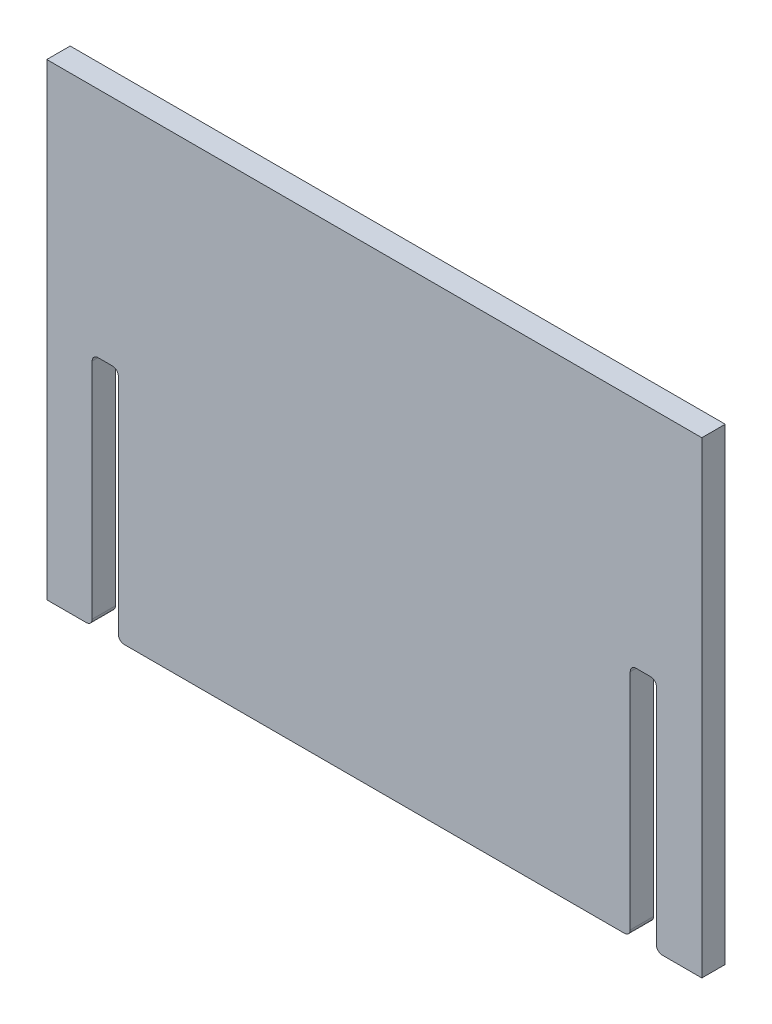
ISO-10303-21;
HEADER;
FILE_DESCRIPTION(('STEP AP214'),'2;1');
FILE_NAME('part.step','',(''),(''),'','','');
FILE_SCHEMA(('AUTOMOTIVE_DESIGN { 1 0 10303 214 1 1 1 1 }'));
ENDSEC;
DATA;
#1=APPLICATION_CONTEXT('core data for automotive mechanical design processes');
#2=APPLICATION_PROTOCOL_DEFINITION('international standard','automotive_design',2000,#1);
#3=PRODUCT_CONTEXT('',#1,'mechanical');
#4=PRODUCT('Part','Part','',(#3));
#5=PRODUCT_RELATED_PRODUCT_CATEGORY('part','',(#4));
#6=PRODUCT_DEFINITION_FORMATION('','',#4);
#7=PRODUCT_DEFINITION_CONTEXT('part definition',#1,'design');
#8=PRODUCT_DEFINITION('design','',#6,#7);
#9=PRODUCT_DEFINITION_SHAPE('','',#8);
#10=(LENGTH_UNIT() NAMED_UNIT(*) SI_UNIT(.MILLI.,.METRE.));
#11=(NAMED_UNIT(*) PLANE_ANGLE_UNIT() SI_UNIT($,.RADIAN.));
#12=(NAMED_UNIT(*) SI_UNIT($,.STERADIAN.) SOLID_ANGLE_UNIT());
#13=UNCERTAINTY_MEASURE_WITH_UNIT(LENGTH_MEASURE(1.E-05),#10,'distance_accuracy_value','');
#14=(GEOMETRIC_REPRESENTATION_CONTEXT(3) GLOBAL_UNCERTAINTY_ASSIGNED_CONTEXT((#13)) GLOBAL_UNIT_ASSIGNED_CONTEXT((#10,
#11,#12)) REPRESENTATION_CONTEXT('',''));
#15=CARTESIAN_POINT('',(0.,0.,0.));
#16=DIRECTION('',(0.,0.,1.));
#17=DIRECTION('',(1.,0.,0.));
#18=AXIS2_PLACEMENT_3D('',#15,#16,#17);
#19=CARTESIAN_POINT('',(1294.20395565763,-24.1798672236195,6.35));
#20=DIRECTION('',(1.,0.,0.));
#21=DIRECTION('',(0.,0.,-1.));
#22=AXIS2_PLACEMENT_3D('',#19,#20,#21);
#23=PLANE('',#22);
#24=DIRECTION('',(0.,-1.,0.));
#25=VECTOR('',#24,1.);
#26=CARTESIAN_POINT('',(1294.20395565763,-24.1798672236195,-6.35));
#27=LINE('',#26,#25);
#28=CARTESIAN_POINT('',(1294.20395565763,-24.1798672236195,-6.35));
#29=VERTEX_POINT('',#28);
#30=CARTESIAN_POINT('',(1294.20395565763,-278.17986722362,-6.35));
#31=VERTEX_POINT('',#30);
#32=EDGE_CURVE('E209',#29,#31,#27,.T.);
#33=ORIENTED_EDGE('',*,*,#32,.T.);
#34=DIRECTION('',(0.,0.,-1.));
#35=VECTOR('',#34,1.);
#36=CARTESIAN_POINT('',(1294.20395565763,-278.17986722362,6.35));
#37=LINE('',#36,#35);
#38=CARTESIAN_POINT('',(1294.20395565763,-278.17986722362,6.35));
#39=VERTEX_POINT('',#38);
#40=EDGE_CURVE('E188',#39,#31,#37,.T.);
#41=ORIENTED_EDGE('',*,*,#40,.F.);
#42=DIRECTION('',(0.,-1.,0.));
#43=VECTOR('',#42,1.);
#44=CARTESIAN_POINT('',(1294.20395565763,-24.1798672236195,6.35));
#45=LINE('',#44,#43);
#46=CARTESIAN_POINT('',(1294.20395565763,-24.1798672236195,6.35));
#47=VERTEX_POINT('',#46);
#48=EDGE_CURVE('E195',#47,#39,#45,.T.);
#49=ORIENTED_EDGE('',*,*,#48,.F.);
#50=DIRECTION('',(0.,0.,-1.));
#51=VECTOR('',#50,1.);
#52=CARTESIAN_POINT('',(1294.20395565763,-24.1798672236195,6.35));
#53=LINE('',#52,#51);
#54=EDGE_CURVE('E410',#47,#29,#53,.T.);
#55=ORIENTED_EDGE('',*,*,#54,.T.);
#56=EDGE_LOOP('',(#33,#41,#49,#55));
#57=FACE_BOUND('',#56,.T.);
#58=ADVANCED_FACE('F44',(#57),#23,.F.);
#59=CARTESIAN_POINT('',(1294.20395565763,-278.17986722362,6.35));
#60=DIRECTION('',(0.,1.,0.));
#61=DIRECTION('',(0.,0.,1.));
#62=AXIS2_PLACEMENT_3D('',#59,#60,#61);
#63=PLANE('',#62);
#64=DIRECTION('',(1.,0.,0.));
#65=VECTOR('',#64,1.);
#66=CARTESIAN_POINT('',(1294.20395565763,-278.17986722362,-6.35));
#67=LINE('',#66,#65);
#68=CARTESIAN_POINT('',(1315.66695565763,-278.17986722362,-6.35));
#69=VERTEX_POINT('',#68);
#70=EDGE_CURVE('E253',#31,#69,#67,.T.);
#71=ORIENTED_EDGE('',*,*,#70,.T.);
#72=DIRECTION('',(0.,0.,-1.));
#73=VECTOR('',#72,1.);
#74=CARTESIAN_POINT('',(1315.66695565763,-278.17986722362,6.35));
#75=LINE('',#74,#73);
#76=CARTESIAN_POINT('',(1315.66695565763,-278.17986722362,6.35));
#77=VERTEX_POINT('',#76);
#78=EDGE_CURVE('E191',#69,#77,#75,.F.);
#79=ORIENTED_EDGE('',*,*,#78,.T.);
#80=DIRECTION('',(1.,0.,0.));
#81=VECTOR('',#80,1.);
#82=CARTESIAN_POINT('',(1294.20395565763,-278.17986722362,6.35));
#83=LINE('',#82,#81);
#84=EDGE_CURVE('E183',#39,#77,#83,.T.);
#85=ORIENTED_EDGE('',*,*,#84,.F.);
#86=ORIENTED_EDGE('',*,*,#40,.T.);
#87=EDGE_LOOP('',(#71,#79,#85,#86));
#88=FACE_BOUND('',#87,.T.);
#89=ADVANCED_FACE('F186',(#88),#63,.F.);
#90=CARTESIAN_POINT('',(1318.84195565763,-278.17986722362,6.35));
#91=DIRECTION('',(-1.,0.,0.));
#92=DIRECTION('',(0.,0.,1.));
#93=AXIS2_PLACEMENT_3D('',#90,#91,#92);
#94=PLANE('',#93);
#95=DIRECTION('',(0.,1.,0.));
#96=VECTOR('',#95,1.);
#97=CARTESIAN_POINT('',(1318.84195565763,-278.17986722362,6.35));
#98=LINE('',#97,#96);
#99=CARTESIAN_POINT('',(1318.84195565763,-275.00486722362,6.35));
#100=VERTEX_POINT('',#99);
#101=CARTESIAN_POINT('',(1318.84195565763,-153.59286722362,6.35));
#102=VERTEX_POINT('',#101);
#103=EDGE_CURVE('E194',#100,#102,#98,.T.);
#104=ORIENTED_EDGE('',*,*,#103,.F.);
#105=DIRECTION('',(0.,0.,-1.));
#106=VECTOR('',#105,1.);
#107=CARTESIAN_POINT('',(1318.84195565763,-275.00486722362,6.35));
#108=LINE('',#107,#106);
#109=CARTESIAN_POINT('',(1318.84195565763,-275.00486722362,-6.35));
#110=VERTEX_POINT('',#109);
#111=EDGE_CURVE('E326',#100,#110,#108,.T.);
#112=ORIENTED_EDGE('',*,*,#111,.T.);
#113=DIRECTION('',(0.,1.,0.));
#114=VECTOR('',#113,1.);
#115=CARTESIAN_POINT('',(1318.84195565763,-278.17986722362,-6.35));
#116=LINE('',#115,#114);
#117=CARTESIAN_POINT('',(1318.84195565763,-153.59286722362,-6.35));
#118=VERTEX_POINT('',#117);
#119=EDGE_CURVE('E248',#110,#118,#116,.T.);
#120=ORIENTED_EDGE('',*,*,#119,.T.);
#121=DIRECTION('',(0.,0.,-1.));
#122=VECTOR('',#121,1.);
#123=CARTESIAN_POINT('',(1318.84195565763,-153.59286722362,6.35));
#124=LINE('',#123,#122);
#125=EDGE_CURVE('E323',#118,#102,#124,.F.);
#126=ORIENTED_EDGE('',*,*,#125,.T.);
#127=EDGE_LOOP('',(#104,#112,#120,#126));
#128=FACE_BOUND('',#127,.T.);
#129=ADVANCED_FACE('F372',(#128),#94,.F.);
#130=CARTESIAN_POINT('',(1319.60395565763,-150.41786722362,6.35));
#131=DIRECTION('',(0.,1.,0.));
#132=DIRECTION('',(0.,0.,1.));
#133=AXIS2_PLACEMENT_3D('',#130,#131,#132);
#134=PLANE('',#133);
#135=DIRECTION('',(1.,0.,0.));
#136=VECTOR('',#135,1.);
#137=CARTESIAN_POINT('',(1319.60395565763,-150.41786722362,-6.35));
#138=LINE('',#137,#136);
#139=CARTESIAN_POINT('',(1322.01695565763,-150.41786722362,-6.35));
#140=VERTEX_POINT('',#139);
#141=CARTESIAN_POINT('',(1329.89095565763,-150.41786722362,-6.35));
#142=VERTEX_POINT('',#141);
#143=EDGE_CURVE('E252',#140,#142,#138,.T.);
#144=ORIENTED_EDGE('',*,*,#143,.T.);
#145=DIRECTION('',(0.,0.,-1.));
#146=VECTOR('',#145,1.);
#147=CARTESIAN_POINT('',(1329.89095565763,-150.41786722362,6.35));
#148=LINE('',#147,#146);
#149=CARTESIAN_POINT('',(1329.89095565763,-150.41786722362,6.35));
#150=VERTEX_POINT('',#149);
#151=EDGE_CURVE('E342',#142,#150,#148,.F.);
#152=ORIENTED_EDGE('',*,*,#151,.T.);
#153=DIRECTION('',(1.,0.,0.));
#154=VECTOR('',#153,1.);
#155=CARTESIAN_POINT('',(1319.60395565763,-150.41786722362,6.35));
#156=LINE('',#155,#154);
#157=CARTESIAN_POINT('',(1322.01695565763,-150.41786722362,6.35));
#158=VERTEX_POINT('',#157);
#159=EDGE_CURVE('E257',#158,#150,#156,.T.);
#160=ORIENTED_EDGE('',*,*,#159,.F.);
#161=DIRECTION('',(0.,0.,-1.));
#162=VECTOR('',#161,1.);
#163=CARTESIAN_POINT('',(1322.01695565763,-150.41786722362,-6.35));
#164=LINE('',#163,#162);
#165=EDGE_CURVE('E338',#158,#140,#164,.T.);
#166=ORIENTED_EDGE('',*,*,#165,.T.);
#167=EDGE_LOOP('',(#144,#152,#160,#166));
#168=FACE_BOUND('',#167,.T.);
#169=ADVANCED_FACE('F378',(#168),#134,.F.);
#170=CARTESIAN_POINT('',(1333.06595565763,-151.17986722362,6.35));
#171=DIRECTION('',(1.,0.,0.));
#172=DIRECTION('',(0.,0.,-1.));
#173=AXIS2_PLACEMENT_3D('',#170,#171,#172);
#174=PLANE('',#173);
#175=DIRECTION('',(0.,-1.,0.));
#176=VECTOR('',#175,1.);
#177=CARTESIAN_POINT('',(1333.06595565763,-151.17986722362,-6.35));
#178=LINE('',#177,#176);
#179=CARTESIAN_POINT('',(1333.06595565763,-153.59286722362,-6.35));
#180=VERTEX_POINT('',#179);
#181=CARTESIAN_POINT('',(1333.06595565763,-275.00486722362,-6.35));
#182=VERTEX_POINT('',#181);
#183=EDGE_CURVE('E265',#180,#182,#178,.T.);
#184=ORIENTED_EDGE('',*,*,#183,.T.);
#185=DIRECTION('',(0.,0.,-1.));
#186=VECTOR('',#185,1.);
#187=CARTESIAN_POINT('',(1333.06595565763,-275.00486722362,6.35));
#188=LINE('',#187,#186);
#189=CARTESIAN_POINT('',(1333.06595565763,-275.00486722362,6.35));
#190=VERTEX_POINT('',#189);
#191=EDGE_CURVE('E320',#182,#190,#188,.F.);
#192=ORIENTED_EDGE('',*,*,#191,.T.);
#193=DIRECTION('',(0.,-1.,0.));
#194=VECTOR('',#193,1.);
#195=CARTESIAN_POINT('',(1333.06595565763,-151.17986722362,6.35));
#196=LINE('',#195,#194);
#197=CARTESIAN_POINT('',(1333.06595565763,-153.59286722362,6.35));
#198=VERTEX_POINT('',#197);
#199=EDGE_CURVE('E261',#198,#190,#196,.T.);
#200=ORIENTED_EDGE('',*,*,#199,.F.);
#201=DIRECTION('',(0.,0.,-1.));
#202=VECTOR('',#201,1.);
#203=CARTESIAN_POINT('',(1333.06595565763,-153.59286722362,-6.35));
#204=LINE('',#203,#202);
#205=EDGE_CURVE('E316',#198,#180,#204,.T.);
#206=ORIENTED_EDGE('',*,*,#205,.T.);
#207=EDGE_LOOP('',(#184,#192,#200,#206));
#208=FACE_BOUND('',#207,.T.);
#209=ADVANCED_FACE('F386',(#208),#174,.F.);
#210=CARTESIAN_POINT('',(1332.30395565763,-278.17986722362,6.35));
#211=DIRECTION('',(0.,1.,0.));
#212=DIRECTION('',(0.,0.,1.));
#213=AXIS2_PLACEMENT_3D('',#210,#211,#212);
#214=PLANE('',#213);
#215=DIRECTION('',(1.,0.,0.));
#216=VECTOR('',#215,1.);
#217=CARTESIAN_POINT('',(1332.30395565763,-278.17986722362,-6.35));
#218=LINE('',#217,#216);
#219=CARTESIAN_POINT('',(1336.24095565763,-278.17986722362,-6.35));
#220=VERTEX_POINT('',#219);
#221=CARTESIAN_POINT('',(1607.76695565763,-278.17986722362,-6.35));
#222=VERTEX_POINT('',#221);
#223=EDGE_CURVE('E236',#220,#222,#218,.T.);
#224=ORIENTED_EDGE('',*,*,#223,.T.);
#225=DIRECTION('',(0.,0.,-1.));
#226=VECTOR('',#225,1.);
#227=CARTESIAN_POINT('',(1607.76695565763,-278.17986722362,6.35));
#228=LINE('',#227,#226);
#229=CARTESIAN_POINT('',(1607.76695565763,-278.17986722362,6.35));
#230=VERTEX_POINT('',#229);
#231=EDGE_CURVE('E313',#222,#230,#228,.F.);
#232=ORIENTED_EDGE('',*,*,#231,.T.);
#233=DIRECTION('',(1.,0.,0.));
#234=VECTOR('',#233,1.);
#235=CARTESIAN_POINT('',(1332.30395565763,-278.17986722362,6.35));
#236=LINE('',#235,#234);
#237=CARTESIAN_POINT('',(1336.24095565763,-278.17986722362,6.35));
#238=VERTEX_POINT('',#237);
#239=EDGE_CURVE('E241',#238,#230,#236,.T.);
#240=ORIENTED_EDGE('',*,*,#239,.F.);
#241=DIRECTION('',(0.,0.,-1.));
#242=VECTOR('',#241,1.);
#243=CARTESIAN_POINT('',(1336.24095565763,-278.17986722362,6.35));
#244=LINE('',#243,#242);
#245=EDGE_CURVE('E309',#238,#220,#244,.T.);
#246=ORIENTED_EDGE('',*,*,#245,.T.);
#247=EDGE_LOOP('',(#224,#232,#240,#246));
#248=FACE_BOUND('',#247,.T.);
#249=ADVANCED_FACE('F397',(#248),#214,.F.);
#250=CARTESIAN_POINT('',(1610.94195565763,-278.17986722362,6.35));
#251=DIRECTION('',(-1.,0.,0.));
#252=DIRECTION('',(0.,0.,1.));
#253=AXIS2_PLACEMENT_3D('',#250,#251,#252);
#254=PLANE('',#253);
#255=DIRECTION('',(0.,1.,0.));
#256=VECTOR('',#255,1.);
#257=CARTESIAN_POINT('',(1610.94195565763,-278.17986722362,6.35));
#258=LINE('',#257,#256);
#259=CARTESIAN_POINT('',(1610.94195565763,-275.00486722362,6.35));
#260=VERTEX_POINT('',#259);
#261=CARTESIAN_POINT('',(1610.94195565763,-153.59286722362,6.35));
#262=VERTEX_POINT('',#261);
#263=EDGE_CURVE('E237',#260,#262,#258,.T.);
#264=ORIENTED_EDGE('',*,*,#263,.F.);
#265=DIRECTION('',(0.,0.,-1.));
#266=VECTOR('',#265,1.);
#267=CARTESIAN_POINT('',(1610.94195565763,-275.00486722362,6.35));
#268=LINE('',#267,#266);
#269=CARTESIAN_POINT('',(1610.94195565763,-275.00486722362,-6.35));
#270=VERTEX_POINT('',#269);
#271=EDGE_CURVE('E305',#260,#270,#268,.T.);
#272=ORIENTED_EDGE('',*,*,#271,.T.);
#273=DIRECTION('',(0.,1.,0.));
#274=VECTOR('',#273,1.);
#275=CARTESIAN_POINT('',(1610.94195565763,-278.17986722362,-6.35));
#276=LINE('',#275,#274);
#277=CARTESIAN_POINT('',(1610.94195565763,-153.59286722362,-6.35));
#278=VERTEX_POINT('',#277);
#279=EDGE_CURVE('E232',#270,#278,#276,.T.);
#280=ORIENTED_EDGE('',*,*,#279,.T.);
#281=DIRECTION('',(0.,0.,-1.));
#282=VECTOR('',#281,1.);
#283=CARTESIAN_POINT('',(1610.94195565763,-153.59286722362,6.35));
#284=LINE('',#283,#282);
#285=EDGE_CURVE('E302',#278,#262,#284,.F.);
#286=ORIENTED_EDGE('',*,*,#285,.T.);
#287=EDGE_LOOP('',(#264,#272,#280,#286));
#288=FACE_BOUND('',#287,.T.);
#289=ADVANCED_FACE('F464',(#288),#254,.F.);
#290=CARTESIAN_POINT('',(1611.70395565763,-150.41786722362,6.35));
#291=DIRECTION('',(0.,1.,0.));
#292=DIRECTION('',(0.,0.,1.));
#293=AXIS2_PLACEMENT_3D('',#290,#291,#292);
#294=PLANE('',#293);
#295=DIRECTION('',(1.,0.,0.));
#296=VECTOR('',#295,1.);
#297=CARTESIAN_POINT('',(1611.70395565763,-150.41786722362,-6.35));
#298=LINE('',#297,#296);
#299=CARTESIAN_POINT('',(1614.11695565763,-150.41786722362,-6.35));
#300=VERTEX_POINT('',#299);
#301=CARTESIAN_POINT('',(1621.99095565763,-150.41786722362,-6.35));
#302=VERTEX_POINT('',#301);
#303=EDGE_CURVE('E229',#300,#302,#298,.T.);
#304=ORIENTED_EDGE('',*,*,#303,.T.);
#305=DIRECTION('',(0.,0.,-1.));
#306=VECTOR('',#305,1.);
#307=CARTESIAN_POINT('',(1621.99095565763,-150.41786722362,6.35));
#308=LINE('',#307,#306);
#309=CARTESIAN_POINT('',(1621.99095565763,-150.41786722362,6.35));
#310=VERTEX_POINT('',#309);
#311=EDGE_CURVE('E60',#302,#310,#308,.F.);
#312=ORIENTED_EDGE('',*,*,#311,.T.);
#313=DIRECTION('',(1.,0.,0.));
#314=VECTOR('',#313,1.);
#315=CARTESIAN_POINT('',(1611.70395565763,-150.41786722362,6.35));
#316=LINE('',#315,#314);
#317=CARTESIAN_POINT('',(1614.11695565763,-150.41786722362,6.35));
#318=VERTEX_POINT('',#317);
#319=EDGE_CURVE('E240',#318,#310,#316,.T.);
#320=ORIENTED_EDGE('',*,*,#319,.F.);
#321=DIRECTION('',(0.,0.,-1.));
#322=VECTOR('',#321,1.);
#323=CARTESIAN_POINT('',(1614.11695565763,-150.41786722362,-6.35));
#324=LINE('',#323,#322);
#325=EDGE_CURVE('E332',#318,#300,#324,.T.);
#326=ORIENTED_EDGE('',*,*,#325,.T.);
#327=EDGE_LOOP('',(#304,#312,#320,#326));
#328=FACE_BOUND('',#327,.T.);
#329=ADVANCED_FACE('F460',(#328),#294,.F.);
#330=CARTESIAN_POINT('',(1625.16595565763,-151.17986722362,6.35));
#331=DIRECTION('',(1.,0.,0.));
#332=DIRECTION('',(0.,0.,-1.));
#333=AXIS2_PLACEMENT_3D('',#330,#331,#332);
#334=PLANE('',#333);
#335=DIRECTION('',(0.,-1.,0.));
#336=VECTOR('',#335,1.);
#337=CARTESIAN_POINT('',(1625.16595565763,-151.17986722362,-6.35));
#338=LINE('',#337,#336);
#339=CARTESIAN_POINT('',(1625.16595565763,-153.59286722362,-6.35));
#340=VERTEX_POINT('',#339);
#341=CARTESIAN_POINT('',(1625.16595565763,-275.00486722362,-6.35));
#342=VERTEX_POINT('',#341);
#343=EDGE_CURVE('E224',#340,#342,#338,.T.);
#344=ORIENTED_EDGE('',*,*,#343,.T.);
#345=DIRECTION('',(0.,0.,-1.));
#346=VECTOR('',#345,1.);
#347=CARTESIAN_POINT('',(1625.16595565763,-275.00486722362,6.35));
#348=LINE('',#347,#346);
#349=CARTESIAN_POINT('',(1625.16595565763,-275.00486722362,6.35));
#350=VERTEX_POINT('',#349);
#351=EDGE_CURVE('E287',#342,#350,#348,.F.);
#352=ORIENTED_EDGE('',*,*,#351,.T.);
#353=DIRECTION('',(0.,-1.,0.));
#354=VECTOR('',#353,1.);
#355=CARTESIAN_POINT('',(1625.16595565763,-151.17986722362,6.35));
#356=LINE('',#355,#354);
#357=CARTESIAN_POINT('',(1625.16595565763,-153.59286722362,6.35));
#358=VERTEX_POINT('',#357);
#359=EDGE_CURVE('E244',#358,#350,#356,.T.);
#360=ORIENTED_EDGE('',*,*,#359,.F.);
#361=DIRECTION('',(0.,0.,-1.));
#362=VECTOR('',#361,1.);
#363=CARTESIAN_POINT('',(1625.16595565763,-153.59286722362,-6.35));
#364=LINE('',#363,#362);
#365=EDGE_CURVE('E283',#358,#340,#364,.T.);
#366=ORIENTED_EDGE('',*,*,#365,.T.);
#367=EDGE_LOOP('',(#344,#352,#360,#366));
#368=FACE_BOUND('',#367,.T.);
#369=ADVANCED_FACE('F456',(#368),#334,.F.);
#370=CARTESIAN_POINT('',(1624.40395565763,-278.17986722362,6.35));
#371=DIRECTION('',(0.,1.,0.));
#372=DIRECTION('',(0.,0.,1.));
#373=AXIS2_PLACEMENT_3D('',#370,#371,#372);
#374=PLANE('',#373);
#375=DIRECTION('',(1.,0.,0.));
#376=VECTOR('',#375,1.);
#377=CARTESIAN_POINT('',(1624.40395565763,-278.17986722362,6.35));
#378=LINE('',#377,#376);
#379=CARTESIAN_POINT('',(1628.34095565763,-278.17986722362,6.35));
#380=VERTEX_POINT('',#379);
#381=CARTESIAN_POINT('',(1649.80395565763,-278.17986722362,6.35));
#382=VERTEX_POINT('',#381);
#383=EDGE_CURVE('E247',#380,#382,#378,.T.);
#384=ORIENTED_EDGE('',*,*,#383,.F.);
#385=DIRECTION('',(0.,0.,-1.));
#386=VECTOR('',#385,1.);
#387=CARTESIAN_POINT('',(1628.34095565763,-278.17986722362,6.35));
#388=LINE('',#387,#386);
#389=CARTESIAN_POINT('',(1628.34095565763,-278.17986722362,-6.35));
#390=VERTEX_POINT('',#389);
#391=EDGE_CURVE('E211',#380,#390,#388,.T.);
#392=ORIENTED_EDGE('',*,*,#391,.T.);
#393=DIRECTION('',(1.,0.,0.));
#394=VECTOR('',#393,1.);
#395=CARTESIAN_POINT('',(1624.40395565763,-278.17986722362,-6.35));
#396=LINE('',#395,#394);
#397=CARTESIAN_POINT('',(1649.80395565763,-278.17986722362,-6.35));
#398=VERTEX_POINT('',#397);
#399=EDGE_CURVE('E228',#390,#398,#396,.T.);
#400=ORIENTED_EDGE('',*,*,#399,.T.);
#401=DIRECTION('',(0.,0.,-1.));
#402=VECTOR('',#401,1.);
#403=CARTESIAN_POINT('',(1649.80395565763,-278.17986722362,6.35));
#404=LINE('',#403,#402);
#405=EDGE_CURVE('E212',#382,#398,#404,.T.);
#406=ORIENTED_EDGE('',*,*,#405,.F.);
#407=EDGE_LOOP('',(#384,#392,#400,#406));
#408=FACE_BOUND('',#407,.T.);
#409=ADVANCED_FACE('F459',(#408),#374,.F.);
#410=CARTESIAN_POINT('',(1649.80395565763,-24.1798672236195,6.35));
#411=DIRECTION('',(-1.,0.,0.));
#412=DIRECTION('',(0.,0.,1.));
#413=AXIS2_PLACEMENT_3D('',#410,#411,#412);
#414=PLANE('',#413);
#415=DIRECTION('',(0.,1.,0.));
#416=VECTOR('',#415,1.);
#417=CARTESIAN_POINT('',(1649.80395565763,-24.1798672236195,-6.35));
#418=LINE('',#417,#416);
#419=CARTESIAN_POINT('',(1649.80395565763,-24.1798672236195,-6.35));
#420=VERTEX_POINT('',#419);
#421=EDGE_CURVE('E419',#398,#420,#418,.T.);
#422=ORIENTED_EDGE('',*,*,#421,.T.);
#423=DIRECTION('',(0.,0.,-1.));
#424=VECTOR('',#423,1.);
#425=CARTESIAN_POINT('',(1649.80395565763,-24.1798672236195,6.35));
#426=LINE('',#425,#424);
#427=CARTESIAN_POINT('',(1649.80395565763,-24.1798672236195,6.35));
#428=VERTEX_POINT('',#427);
#429=EDGE_CURVE('E220',#428,#420,#426,.T.);
#430=ORIENTED_EDGE('',*,*,#429,.F.);
#431=DIRECTION('',(0.,1.,0.));
#432=VECTOR('',#431,1.);
#433=CARTESIAN_POINT('',(1649.80395565763,-24.1798672236195,6.35));
#434=LINE('',#433,#432);
#435=EDGE_CURVE('E405',#382,#428,#434,.T.);
#436=ORIENTED_EDGE('',*,*,#435,.F.);
#437=ORIENTED_EDGE('',*,*,#405,.T.);
#438=EDGE_LOOP('',(#422,#430,#436,#437));
#439=FACE_BOUND('',#438,.T.);
#440=ADVANCED_FACE('F499',(#439),#414,.F.);
#441=CARTESIAN_POINT('',(1294.20395565763,-24.1798672236195,6.35));
#442=DIRECTION('',(0.,-1.,0.));
#443=DIRECTION('',(0.,0.,-1.));
#444=AXIS2_PLACEMENT_3D('',#441,#442,#443);
#445=PLANE('',#444);
#446=DIRECTION('',(-1.,0.,0.));
#447=VECTOR('',#446,1.);
#448=CARTESIAN_POINT('',(1294.20395565763,-24.1798672236195,-6.35));
#449=LINE('',#448,#447);
#450=EDGE_CURVE('E206',#420,#29,#449,.T.);
#451=ORIENTED_EDGE('',*,*,#450,.T.);
#452=ORIENTED_EDGE('',*,*,#54,.F.);
#453=DIRECTION('',(-1.,0.,0.));
#454=VECTOR('',#453,1.);
#455=CARTESIAN_POINT('',(1294.20395565763,-24.1798672236195,6.35));
#456=LINE('',#455,#454);
#457=EDGE_CURVE('E201',#428,#47,#456,.T.);
#458=ORIENTED_EDGE('',*,*,#457,.F.);
#459=ORIENTED_EDGE('',*,*,#429,.T.);
#460=EDGE_LOOP('',(#451,#452,#458,#459));
#461=FACE_BOUND('',#460,.T.);
#462=ADVANCED_FACE('F430',(#461),#445,.F.);
#463=CARTESIAN_POINT('',(0.,0.,6.35));
#464=DIRECTION('',(0.,0.,1.));
#465=DIRECTION('',(1.,0.,0.));
#466=AXIS2_PLACEMENT_3D('',#463,#464,#465);
#467=PLANE('',#466);
#468=ORIENTED_EDGE('',*,*,#359,.T.);
#469=CARTESIAN_POINT('',(1628.34095565763,-275.00486722362,6.35));
#470=DIRECTION('',(0.,0.,1.));
#471=DIRECTION('',(1.,0.,0.));
#472=AXIS2_PLACEMENT_3D('',#469,#470,#471);
#473=CIRCLE('',#472,3.175);
#474=EDGE_CURVE('E299',#350,#380,#473,.T.);
#475=ORIENTED_EDGE('',*,*,#474,.T.);
#476=ORIENTED_EDGE('',*,*,#383,.T.);
#477=ORIENTED_EDGE('',*,*,#435,.T.);
#478=ORIENTED_EDGE('',*,*,#457,.T.);
#479=ORIENTED_EDGE('',*,*,#48,.T.);
#480=ORIENTED_EDGE('',*,*,#84,.T.);
#481=CARTESIAN_POINT('',(1315.66695565763,-275.00486722362,6.35));
#482=DIRECTION('',(0.,0.,1.));
#483=DIRECTION('',(1.,0.,0.));
#484=AXIS2_PLACEMENT_3D('',#481,#482,#483);
#485=CIRCLE('',#484,3.175);
#486=EDGE_CURVE('E290',#77,#100,#485,.T.);
#487=ORIENTED_EDGE('',*,*,#486,.T.);
#488=ORIENTED_EDGE('',*,*,#103,.T.);
#489=CARTESIAN_POINT('',(1322.01695565763,-153.59286722362,6.35));
#490=DIRECTION('',(0.,0.,1.));
#491=DIRECTION('',(1.,0.,0.));
#492=AXIS2_PLACEMENT_3D('',#489,#490,#491);
#493=CIRCLE('',#492,3.175);
#494=EDGE_CURVE('E12',#102,#158,#493,.F.);
#495=ORIENTED_EDGE('',*,*,#494,.T.);
#496=ORIENTED_EDGE('',*,*,#159,.T.);
#497=CARTESIAN_POINT('',(1329.89095565763,-153.59286722362,6.35));
#498=DIRECTION('',(0.,0.,1.));
#499=DIRECTION('',(1.,0.,0.));
#500=AXIS2_PLACEMENT_3D('',#497,#498,#499);
#501=CIRCLE('',#500,3.175);
#502=EDGE_CURVE('E359',#150,#198,#501,.F.);
#503=ORIENTED_EDGE('',*,*,#502,.T.);
#504=ORIENTED_EDGE('',*,*,#199,.T.);
#505=CARTESIAN_POINT('',(1336.24095565763,-275.00486722362,6.35));
#506=DIRECTION('',(0.,0.,1.));
#507=DIRECTION('',(1.,0.,0.));
#508=AXIS2_PLACEMENT_3D('',#505,#506,#507);
#509=CIRCLE('',#508,3.175);
#510=EDGE_CURVE('E293',#190,#238,#509,.T.);
#511=ORIENTED_EDGE('',*,*,#510,.T.);
#512=ORIENTED_EDGE('',*,*,#239,.T.);
#513=CARTESIAN_POINT('',(1607.76695565763,-275.00486722362,6.35));
#514=DIRECTION('',(0.,0.,1.));
#515=DIRECTION('',(1.,0.,0.));
#516=AXIS2_PLACEMENT_3D('',#513,#514,#515);
#517=CIRCLE('',#516,3.175);
#518=EDGE_CURVE('E296',#230,#260,#517,.T.);
#519=ORIENTED_EDGE('',*,*,#518,.T.);
#520=ORIENTED_EDGE('',*,*,#263,.T.);
#521=CARTESIAN_POINT('',(1614.11695565763,-153.59286722362,6.35));
#522=DIRECTION('',(0.,0.,1.));
#523=DIRECTION('',(1.,0.,0.));
#524=AXIS2_PLACEMENT_3D('',#521,#522,#523);
#525=CIRCLE('',#524,3.175);
#526=EDGE_CURVE('E67',#262,#318,#525,.F.);
#527=ORIENTED_EDGE('',*,*,#526,.T.);
#528=ORIENTED_EDGE('',*,*,#319,.T.);
#529=CARTESIAN_POINT('',(1621.99095565763,-153.59286722362,6.35));
#530=DIRECTION('',(0.,0.,1.));
#531=DIRECTION('',(1.,0.,0.));
#532=AXIS2_PLACEMENT_3D('',#529,#530,#531);
#533=CIRCLE('',#532,3.175);
#534=EDGE_CURVE('E348',#310,#358,#533,.F.);
#535=ORIENTED_EDGE('',*,*,#534,.T.);
#536=EDGE_LOOP('',(#468,#475,#476,#477,#478,#479,#480,#487,#488,#495,#496,#503,#504,#511,#512,
#519,#520,#527,#528,#535));
#537=FACE_BOUND('',#536,.T.);
#538=ADVANCED_FACE('F199',(#537),#467,.T.);
#539=CARTESIAN_POINT('',(0.,0.,-6.35));
#540=DIRECTION('',(0.,0.,1.));
#541=DIRECTION('',(1.,0.,0.));
#542=AXIS2_PLACEMENT_3D('',#539,#540,#541);
#543=PLANE('',#542);
#544=ORIENTED_EDGE('',*,*,#399,.F.);
#545=CARTESIAN_POINT('',(1628.34095565763,-275.00486722362,-6.35));
#546=DIRECTION('',(0.,0.,1.));
#547=DIRECTION('',(1.,0.,0.));
#548=AXIS2_PLACEMENT_3D('',#545,#546,#547);
#549=CIRCLE('',#548,3.175);
#550=EDGE_CURVE('E280',#390,#342,#549,.F.);
#551=ORIENTED_EDGE('',*,*,#550,.T.);
#552=ORIENTED_EDGE('',*,*,#343,.F.);
#553=CARTESIAN_POINT('',(1621.99095565763,-153.59286722362,-6.35));
#554=DIRECTION('',(0.,0.,1.));
#555=DIRECTION('',(1.,0.,0.));
#556=AXIS2_PLACEMENT_3D('',#553,#554,#555);
#557=CIRCLE('',#556,3.175);
#558=EDGE_CURVE('E345',#340,#302,#557,.T.);
#559=ORIENTED_EDGE('',*,*,#558,.T.);
#560=ORIENTED_EDGE('',*,*,#303,.F.);
#561=CARTESIAN_POINT('',(1614.11695565763,-153.59286722362,-6.35));
#562=DIRECTION('',(0.,0.,1.));
#563=DIRECTION('',(1.,0.,0.));
#564=AXIS2_PLACEMENT_3D('',#561,#562,#563);
#565=CIRCLE('',#564,3.175);
#566=EDGE_CURVE('E351',#300,#278,#565,.T.);
#567=ORIENTED_EDGE('',*,*,#566,.T.);
#568=ORIENTED_EDGE('',*,*,#279,.F.);
#569=CARTESIAN_POINT('',(1607.76695565763,-275.00486722362,-6.35));
#570=DIRECTION('',(0.,0.,1.));
#571=DIRECTION('',(1.,0.,0.));
#572=AXIS2_PLACEMENT_3D('',#569,#570,#571);
#573=CIRCLE('',#572,3.175);
#574=EDGE_CURVE('E277',#270,#222,#573,.F.);
#575=ORIENTED_EDGE('',*,*,#574,.T.);
#576=ORIENTED_EDGE('',*,*,#223,.F.);
#577=CARTESIAN_POINT('',(1336.24095565763,-275.00486722362,-6.35));
#578=DIRECTION('',(0.,0.,1.));
#579=DIRECTION('',(1.,0.,0.));
#580=AXIS2_PLACEMENT_3D('',#577,#578,#579);
#581=CIRCLE('',#580,3.175);
#582=EDGE_CURVE('E274',#220,#182,#581,.F.);
#583=ORIENTED_EDGE('',*,*,#582,.T.);
#584=ORIENTED_EDGE('',*,*,#183,.F.);
#585=CARTESIAN_POINT('',(1329.89095565763,-153.59286722362,-6.35));
#586=DIRECTION('',(0.,0.,1.));
#587=DIRECTION('',(1.,0.,0.));
#588=AXIS2_PLACEMENT_3D('',#585,#586,#587);
#589=CIRCLE('',#588,3.175);
#590=EDGE_CURVE('E356',#180,#142,#589,.T.);
#591=ORIENTED_EDGE('',*,*,#590,.T.);
#592=ORIENTED_EDGE('',*,*,#143,.F.);
#593=CARTESIAN_POINT('',(1322.01695565763,-153.59286722362,-6.35));
#594=DIRECTION('',(0.,0.,1.));
#595=DIRECTION('',(1.,0.,0.));
#596=AXIS2_PLACEMENT_3D('',#593,#594,#595);
#597=CIRCLE('',#596,3.175);
#598=EDGE_CURVE('E53',#140,#118,#597,.T.);
#599=ORIENTED_EDGE('',*,*,#598,.T.);
#600=ORIENTED_EDGE('',*,*,#119,.F.);
#601=CARTESIAN_POINT('',(1315.66695565763,-275.00486722362,-6.35));
#602=DIRECTION('',(0.,0.,1.));
#603=DIRECTION('',(1.,0.,0.));
#604=AXIS2_PLACEMENT_3D('',#601,#602,#603);
#605=CIRCLE('',#604,3.175);
#606=EDGE_CURVE('E217',#110,#69,#605,.F.);
#607=ORIENTED_EDGE('',*,*,#606,.T.);
#608=ORIENTED_EDGE('',*,*,#70,.F.);
#609=ORIENTED_EDGE('',*,*,#32,.F.);
#610=ORIENTED_EDGE('',*,*,#450,.F.);
#611=ORIENTED_EDGE('',*,*,#421,.F.);
#612=EDGE_LOOP('',(#544,#551,#552,#559,#560,#567,#568,#575,#576,#583,#584,#591,#592,#599,#600,
#607,#608,#609,#610,#611));
#613=FACE_BOUND('',#612,.T.);
#614=ADVANCED_FACE('F366',(#613),#543,.F.);
#615=CARTESIAN_POINT('',(1628.34095565763,-275.00486722362,6.35));
#616=DIRECTION('',(0.,0.,-1.));
#617=DIRECTION('',(-1.,0.,0.));
#618=AXIS2_PLACEMENT_3D('',#615,#616,#617);
#619=CYLINDRICAL_SURFACE('',#618,3.175);
#620=ORIENTED_EDGE('',*,*,#474,.F.);
#621=ORIENTED_EDGE('',*,*,#351,.F.);
#622=ORIENTED_EDGE('',*,*,#550,.F.);
#623=ORIENTED_EDGE('',*,*,#391,.F.);
#624=EDGE_LOOP('',(#620,#621,#622,#623));
#625=FACE_BOUND('',#624,.T.);
#626=ADVANCED_FACE('F474',(#625),#619,.T.);
#627=CARTESIAN_POINT('',(1607.76695565763,-275.00486722362,6.35));
#628=DIRECTION('',(0.,0.,-1.));
#629=DIRECTION('',(-1.,0.,0.));
#630=AXIS2_PLACEMENT_3D('',#627,#628,#629);
#631=CYLINDRICAL_SURFACE('',#630,3.175);
#632=ORIENTED_EDGE('',*,*,#518,.F.);
#633=ORIENTED_EDGE('',*,*,#231,.F.);
#634=ORIENTED_EDGE('',*,*,#574,.F.);
#635=ORIENTED_EDGE('',*,*,#271,.F.);
#636=EDGE_LOOP('',(#632,#633,#634,#635));
#637=FACE_BOUND('',#636,.T.);
#638=ADVANCED_FACE('F446',(#637),#631,.T.);
#639=CARTESIAN_POINT('',(1336.24095565763,-275.00486722362,6.35));
#640=DIRECTION('',(0.,0.,-1.));
#641=DIRECTION('',(-1.,0.,0.));
#642=AXIS2_PLACEMENT_3D('',#639,#640,#641);
#643=CYLINDRICAL_SURFACE('',#642,3.175);
#644=ORIENTED_EDGE('',*,*,#510,.F.);
#645=ORIENTED_EDGE('',*,*,#191,.F.);
#646=ORIENTED_EDGE('',*,*,#582,.F.);
#647=ORIENTED_EDGE('',*,*,#245,.F.);
#648=EDGE_LOOP('',(#644,#645,#646,#647));
#649=FACE_BOUND('',#648,.T.);
#650=ADVANCED_FACE('F390',(#649),#643,.T.);
#651=CARTESIAN_POINT('',(1315.66695565763,-275.00486722362,6.35));
#652=DIRECTION('',(0.,0.,-1.));
#653=DIRECTION('',(-1.,0.,0.));
#654=AXIS2_PLACEMENT_3D('',#651,#652,#653);
#655=CYLINDRICAL_SURFACE('',#654,3.175);
#656=ORIENTED_EDGE('',*,*,#486,.F.);
#657=ORIENTED_EDGE('',*,*,#78,.F.);
#658=ORIENTED_EDGE('',*,*,#606,.F.);
#659=ORIENTED_EDGE('',*,*,#111,.F.);
#660=EDGE_LOOP('',(#656,#657,#658,#659));
#661=FACE_BOUND('',#660,.T.);
#662=ADVANCED_FACE('F435',(#661),#655,.T.);
#663=CARTESIAN_POINT('',(1621.99095565763,-153.59286722362,6.35));
#664=DIRECTION('',(0.,0.,1.));
#665=DIRECTION('',(1.,0.,0.));
#666=AXIS2_PLACEMENT_3D('',#663,#664,#665);
#667=CYLINDRICAL_SURFACE('',#666,3.175);
#668=ORIENTED_EDGE('',*,*,#534,.F.);
#669=ORIENTED_EDGE('',*,*,#311,.F.);
#670=ORIENTED_EDGE('',*,*,#558,.F.);
#671=ORIENTED_EDGE('',*,*,#365,.F.);
#672=EDGE_LOOP('',(#668,#669,#670,#671));
#673=FACE_BOUND('',#672,.T.);
#674=ADVANCED_FACE('F437',(#673),#667,.F.);
#675=CARTESIAN_POINT('',(1614.11695565763,-153.59286722362,6.35));
#676=DIRECTION('',(0.,0.,1.));
#677=DIRECTION('',(1.,0.,0.));
#678=AXIS2_PLACEMENT_3D('',#675,#676,#677);
#679=CYLINDRICAL_SURFACE('',#678,3.175);
#680=ORIENTED_EDGE('',*,*,#526,.F.);
#681=ORIENTED_EDGE('',*,*,#285,.F.);
#682=ORIENTED_EDGE('',*,*,#566,.F.);
#683=ORIENTED_EDGE('',*,*,#325,.F.);
#684=EDGE_LOOP('',(#680,#681,#682,#683));
#685=FACE_BOUND('',#684,.T.);
#686=ADVANCED_FACE('F443',(#685),#679,.F.);
#687=CARTESIAN_POINT('',(1329.89095565763,-153.59286722362,6.35));
#688=DIRECTION('',(0.,0.,1.));
#689=DIRECTION('',(1.,0.,0.));
#690=AXIS2_PLACEMENT_3D('',#687,#688,#689);
#691=CYLINDRICAL_SURFACE('',#690,3.175);
#692=ORIENTED_EDGE('',*,*,#502,.F.);
#693=ORIENTED_EDGE('',*,*,#151,.F.);
#694=ORIENTED_EDGE('',*,*,#590,.F.);
#695=ORIENTED_EDGE('',*,*,#205,.F.);
#696=EDGE_LOOP('',(#692,#693,#694,#695));
#697=FACE_BOUND('',#696,.T.);
#698=ADVANCED_FACE('F381',(#697),#691,.F.);
#699=CARTESIAN_POINT('',(1322.01695565763,-153.59286722362,6.35));
#700=DIRECTION('',(0.,0.,1.));
#701=DIRECTION('',(1.,0.,0.));
#702=AXIS2_PLACEMENT_3D('',#699,#700,#701);
#703=CYLINDRICAL_SURFACE('',#702,3.175);
#704=ORIENTED_EDGE('',*,*,#494,.F.);
#705=ORIENTED_EDGE('',*,*,#125,.F.);
#706=ORIENTED_EDGE('',*,*,#598,.F.);
#707=ORIENTED_EDGE('',*,*,#165,.F.);
#708=EDGE_LOOP('',(#704,#705,#706,#707));
#709=FACE_BOUND('',#708,.T.);
#710=ADVANCED_FACE('F46',(#709),#703,.F.);
#711=CLOSED_SHELL('',(#58,#89,#129,#169,#209,#249,#289,#329,#369,#409,#440,#462,#538,#614,#626,
#638,#650,#662,#674,#686,#698,#710));
#712=MANIFOLD_SOLID_BREP('B2',#711);
#713=ADVANCED_BREP_SHAPE_REPRESENTATION('',(#18,#712),#14);
#714=SHAPE_DEFINITION_REPRESENTATION(#9,#713);
ENDSEC;
END-ISO-10303-21;
